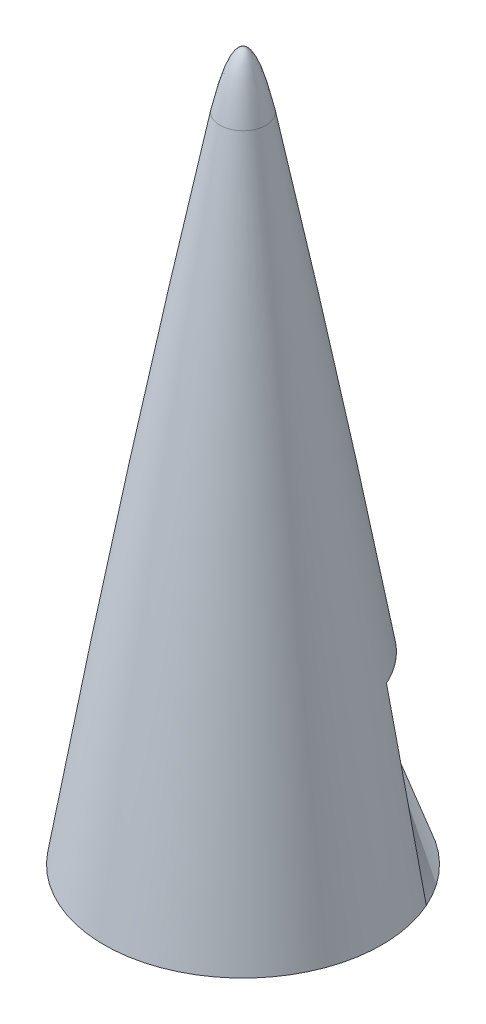
ISO-10303-21;
HEADER;
FILE_DESCRIPTION(('STEP AP214'),'2;1');
FILE_NAME('part.step','',(''),(''),'','','');
FILE_SCHEMA(('AUTOMOTIVE_DESIGN { 1 0 10303 214 1 1 1 1 }'));
ENDSEC;
DATA;
#1=APPLICATION_CONTEXT('core data for automotive mechanical design processes');
#2=APPLICATION_PROTOCOL_DEFINITION('international standard','automotive_design',2000,#1);
#3=PRODUCT_CONTEXT('',#1,'mechanical');
#4=PRODUCT('Part','Part','',(#3));
#5=PRODUCT_RELATED_PRODUCT_CATEGORY('part','',(#4));
#6=PRODUCT_DEFINITION_FORMATION('','',#4);
#7=PRODUCT_DEFINITION_CONTEXT('part definition',#1,'design');
#8=PRODUCT_DEFINITION('design','',#6,#7);
#9=PRODUCT_DEFINITION_SHAPE('','',#8);
#10=(LENGTH_UNIT() NAMED_UNIT(*) SI_UNIT(.MILLI.,.METRE.));
#11=(NAMED_UNIT(*) PLANE_ANGLE_UNIT() SI_UNIT($,.RADIAN.));
#12=(NAMED_UNIT(*) SI_UNIT($,.STERADIAN.) SOLID_ANGLE_UNIT());
#13=UNCERTAINTY_MEASURE_WITH_UNIT(LENGTH_MEASURE(1.E-05),#10,'distance_accuracy_value','');
#14=(GEOMETRIC_REPRESENTATION_CONTEXT(3) GLOBAL_UNCERTAINTY_ASSIGNED_CONTEXT((#13)) GLOBAL_UNIT_ASSIGNED_CONTEXT((#10,
#11,#12)) REPRESENTATION_CONTEXT('',''));
#15=CARTESIAN_POINT('',(0.,0.,0.));
#16=DIRECTION('',(0.,0.,1.));
#17=DIRECTION('',(1.,0.,0.));
#18=AXIS2_PLACEMENT_3D('',#15,#16,#17);
#19=CARTESIAN_POINT('',(-3.5527136788005E-12,1.80102599500742E-08,0.));
#20=DIRECTION('',(0.,1.,0.));
#21=DIRECTION('',(-1.,0.,0.));
#22=AXIS2_PLACEMENT_3D('',#19,#20,#21);
#23=DEGENERATE_TOROIDAL_SURFACE('',#22,5029.19999990055,5130.79999989884,.F.);
#24=CARTESIAN_POINT('',(0.,812.800000000069,0.));
#25=DIRECTION('',(0.,1.,0.));
#26=DIRECTION('',(-1.,0.,0.));
#27=AXIS2_PLACEMENT_3D('',#24,#25,#26);
#28=CIRCLE('',#27,36.8107382434125);
#29=CARTESIAN_POINT('',(-36.8107382434125,812.80000000007,0.));
#30=VERTEX_POINT('',#29);
#31=EDGE_CURVE('E11',#30,#30,#28,.T.);
#32=ORIENTED_EDGE('',*,*,#31,.T.);
#33=EDGE_LOOP('',(#32));
#34=FACE_BOUND('',#33,.T.);
#35=CARTESIAN_POINT('',(0.,985.4578151198,0.));
#36=DIRECTION('',(0.,-1.,0.));
#37=DIRECTION('',(0.,0.,-1.));
#38=AXIS2_PLACEMENT_3D('',#35,#36,#37);
#39=CIRCLE('',#38,6.07372985997312);
#40=CARTESIAN_POINT('',(0.,985.4578151198,-6.07372985997312));
#41=VERTEX_POINT('',#40);
#42=EDGE_CURVE('E44',#41,#41,#39,.T.);
#43=ORIENTED_EDGE('',*,*,#42,.T.);
#44=EDGE_LOOP('',(#43));
#45=FACE_BOUND('',#44,.T.);
#46=ADVANCED_FACE('F38',(#34,#45),#23,.F.);
#47=CARTESIAN_POINT('',(0.,812.800000000035,0.));
#48=DIRECTION('',(0.,-1.,0.));
#49=DIRECTION('',(1.,0.,0.));
#50=AXIS2_PLACEMENT_3D('',#47,#48,#49);
#51=PLANE('',#50);
#52=ORIENTED_EDGE('',*,*,#31,.F.);
#53=EDGE_LOOP('',(#52));
#54=FACE_BOUND('',#53,.T.);
#55=ADVANCED_FACE('F50',(#54),#51,.T.);
#56=CARTESIAN_POINT('',(0.,985.4578151198,-6.07372985997312));
#57=CARTESIAN_POINT('',(0.,1000.33869195154,-3.0131966552106));
#58=CARTESIAN_POINT('',(0.,1000.3224787326,0.));
#59=B_SPLINE_CURVE_WITH_KNOTS('',2,(#56,#57,#58),.UNSPECIFIED.,.F.,.F.,(3,3),(0.,
0.500461160030229),.UNSPECIFIED.);
#60=CARTESIAN_POINT('',(0.,985.4578151198,0.));
#61=DIRECTION('',(0.,-1.,0.));
#62=AXIS1_PLACEMENT('',#60,#61);
#63=SURFACE_OF_REVOLUTION('',#59,#62);
#64=CARTESIAN_POINT('',(0.,1000.3224787326,0.));
#65=VERTEX_POINT('',#64);
#66=VERTEX_LOOP('',#65);
#67=FACE_BOUND('',#66,.T.);
#68=ORIENTED_EDGE('',*,*,#42,.F.);
#69=EDGE_LOOP('',(#68));
#70=FACE_BOUND('',#69,.T.);
#71=ADVANCED_FACE('F47',(#67,#70),#63,.F.);
#72=CLOSED_SHELL('',(#46,#55,#71));
#73=MANIFOLD_SOLID_BREP('B2',#72);
#74=ADVANCED_BREP_SHAPE_REPRESENTATION('',(#18,#73),#14);
#75=SHAPE_DEFINITION_REPRESENTATION(#9,#74);
ENDSEC;
END-ISO-10303-21;
